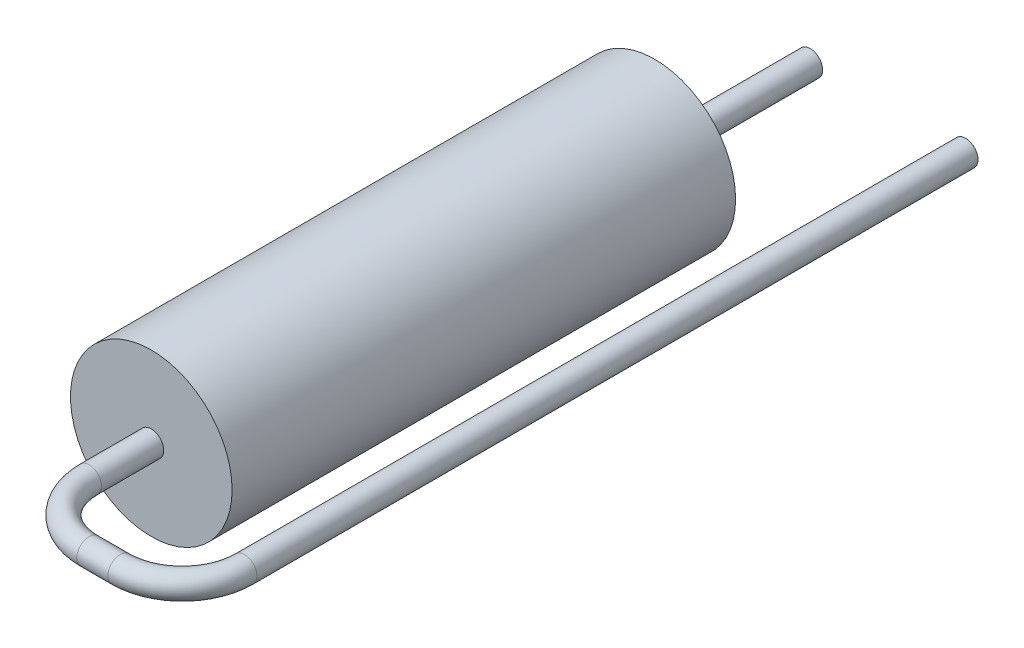
ISO-10303-21;
HEADER;
FILE_DESCRIPTION(('STEP AP214'),'2;1');
FILE_NAME('part.step','',(''),(''),'','','');
FILE_SCHEMA(('AUTOMOTIVE_DESIGN { 1 0 10303 214 1 1 1 1 }'));
ENDSEC;
DATA;
#1=APPLICATION_CONTEXT('core data for automotive mechanical design processes');
#2=APPLICATION_PROTOCOL_DEFINITION('international standard','automotive_design',2000,#1);
#3=PRODUCT_CONTEXT('',#1,'mechanical');
#4=PRODUCT('Part','Part','',(#3));
#5=PRODUCT_RELATED_PRODUCT_CATEGORY('part','',(#4));
#6=PRODUCT_DEFINITION_FORMATION('','',#4);
#7=PRODUCT_DEFINITION_CONTEXT('part definition',#1,'design');
#8=PRODUCT_DEFINITION('design','',#6,#7);
#9=PRODUCT_DEFINITION_SHAPE('','',#8);
#10=(LENGTH_UNIT() NAMED_UNIT(*) SI_UNIT(.MILLI.,.METRE.));
#11=(NAMED_UNIT(*) PLANE_ANGLE_UNIT() SI_UNIT($,.RADIAN.));
#12=(NAMED_UNIT(*) SI_UNIT($,.STERADIAN.) SOLID_ANGLE_UNIT());
#13=UNCERTAINTY_MEASURE_WITH_UNIT(LENGTH_MEASURE(1.E-05),#10,'distance_accuracy_value','');
#14=(GEOMETRIC_REPRESENTATION_CONTEXT(3) GLOBAL_UNCERTAINTY_ASSIGNED_CONTEXT((#13)) GLOBAL_UNIT_ASSIGNED_CONTEXT((#10,
#11,#12)) REPRESENTATION_CONTEXT('',''));
#15=CARTESIAN_POINT('',(0.,0.,0.));
#16=DIRECTION('',(0.,0.,1.));
#17=DIRECTION('',(1.,0.,0.));
#18=AXIS2_PLACEMENT_3D('',#15,#16,#17);
#19=CARTESIAN_POINT('',(0.,0.,0.));
#20=DIRECTION('',(0.,0.,1.));
#21=DIRECTION('',(1.,0.,0.));
#22=AXIS2_PLACEMENT_3D('',#19,#20,#21);
#23=PLANE('',#22);
#24=CARTESIAN_POINT('',(0.,0.,0.));
#25=DIRECTION('',(0.,0.,1.));
#26=DIRECTION('',(1.,0.,0.));
#27=AXIS2_PLACEMENT_3D('',#24,#25,#26);
#28=CIRCLE('',#27,2.6);
#29=CARTESIAN_POINT('',(2.6,0.,0.));
#30=VERTEX_POINT('',#29);
#31=EDGE_CURVE('E47',#30,#30,#28,.T.);
#32=ORIENTED_EDGE('',*,*,#31,.F.);
#33=EDGE_LOOP('',(#32));
#34=FACE_BOUND('',#33,.T.);
#35=CARTESIAN_POINT('',(0.,0.,0.));
#36=DIRECTION('',(0.,0.,1.));
#37=DIRECTION('',(1.,0.,0.));
#38=AXIS2_PLACEMENT_3D('',#35,#36,#37);
#39=CIRCLE('',#38,0.4);
#40=CARTESIAN_POINT('',(0.4,0.,0.));
#41=VERTEX_POINT('',#40);
#42=EDGE_CURVE('E10',#41,#41,#39,.F.);
#43=ORIENTED_EDGE('',*,*,#42,.F.);
#44=EDGE_LOOP('',(#43));
#45=FACE_BOUND('',#44,.T.);
#46=ADVANCED_FACE('F31',(#34,#45),#23,.F.);
#47=CARTESIAN_POINT('',(0.,0.,16.2));
#48=DIRECTION('',(0.,0.,-1.));
#49=DIRECTION('',(-1.,0.,0.));
#50=AXIS2_PLACEMENT_3D('',#47,#48,#49);
#51=CYLINDRICAL_SURFACE('',#50,2.6);
#52=CARTESIAN_POINT('',(0.,0.,16.2));
#53=DIRECTION('',(0.,0.,1.));
#54=DIRECTION('',(1.,0.,0.));
#55=AXIS2_PLACEMENT_3D('',#52,#53,#54);
#56=CIRCLE('',#55,2.6);
#57=CARTESIAN_POINT('',(2.6,0.,16.2));
#58=VERTEX_POINT('',#57);
#59=EDGE_CURVE('E42',#58,#58,#56,.T.);
#60=ORIENTED_EDGE('',*,*,#59,.F.);
#61=EDGE_LOOP('',(#60));
#62=FACE_BOUND('',#61,.T.);
#63=ORIENTED_EDGE('',*,*,#31,.T.);
#64=EDGE_LOOP('',(#63));
#65=FACE_BOUND('',#64,.T.);
#66=ADVANCED_FACE('F33',(#62,#65),#51,.T.);
#67=CARTESIAN_POINT('',(0.,0.,16.2));
#68=DIRECTION('',(0.,0.,1.));
#69=DIRECTION('',(1.,0.,0.));
#70=AXIS2_PLACEMENT_3D('',#67,#68,#69);
#71=PLANE('',#70);
#72=CARTESIAN_POINT('',(0.,0.,16.2));
#73=DIRECTION('',(0.,0.,1.));
#74=DIRECTION('',(1.,0.,0.));
#75=AXIS2_PLACEMENT_3D('',#72,#73,#74);
#76=CIRCLE('',#75,0.4);
#77=CARTESIAN_POINT('',(0.4,0.,16.2));
#78=VERTEX_POINT('',#77);
#79=EDGE_CURVE('E38',#78,#78,#76,.T.);
#80=ORIENTED_EDGE('',*,*,#79,.F.);
#81=EDGE_LOOP('',(#80));
#82=FACE_BOUND('',#81,.T.);
#83=ORIENTED_EDGE('',*,*,#59,.T.);
#84=EDGE_LOOP('',(#83));
#85=FACE_BOUND('',#84,.T.);
#86=ADVANCED_FACE('F73',(#82,#85),#71,.T.);
#87=CARTESIAN_POINT('',(5.,0.,18.2));
#88=DIRECTION('',(0.,0.,-1.));
#89=DIRECTION('',(-1.,0.,0.));
#90=AXIS2_PLACEMENT_3D('',#87,#88,#89);
#91=CYLINDRICAL_SURFACE('',#90,0.4);
#92=CARTESIAN_POINT('',(5.,0.,18.2));
#93=DIRECTION('',(0.,0.,-1.));
#94=DIRECTION('',(-1.,0.,0.));
#95=AXIS2_PLACEMENT_3D('',#92,#93,#94);
#96=CIRCLE('',#95,0.4);
#97=CARTESIAN_POINT('',(5.4,0.,18.2));
#98=VERTEX_POINT('',#97);
#99=EDGE_CURVE('E59',#98,#98,#96,.T.);
#100=ORIENTED_EDGE('',*,*,#99,.T.);
#101=EDGE_LOOP('',(#100));
#102=FACE_BOUND('',#101,.T.);
#103=CARTESIAN_POINT('',(5.,0.,-5.));
#104=DIRECTION('',(0.,0.,-1.));
#105=DIRECTION('',(-1.,0.,0.));
#106=AXIS2_PLACEMENT_3D('',#103,#104,#105);
#107=CIRCLE('',#106,0.4);
#108=CARTESIAN_POINT('',(4.6,0.,-4.99999999999999));
#109=VERTEX_POINT('',#108);
#110=EDGE_CURVE('E62',#109,#109,#107,.T.);
#111=ORIENTED_EDGE('',*,*,#110,.F.);
#112=EDGE_LOOP('',(#111));
#113=FACE_BOUND('',#112,.T.);
#114=ADVANCED_FACE('F78',(#102,#113),#91,.T.);
#115=CARTESIAN_POINT('',(3.,0.,18.2));
#116=DIRECTION('',(0.,1.,0.));
#117=DIRECTION('',(0.,0.,1.));
#118=AXIS2_PLACEMENT_3D('',#115,#116,#117);
#119=TOROIDAL_SURFACE('',#118,2.,0.4);
#120=CARTESIAN_POINT('',(2.99999999999999,0.,20.2));
#121=DIRECTION('',(1.,0.,0.));
#122=DIRECTION('',(0.,0.,-1.));
#123=AXIS2_PLACEMENT_3D('',#120,#121,#122);
#124=CIRCLE('',#123,0.4);
#125=CARTESIAN_POINT('',(2.99999999999998,0.,20.6));
#126=VERTEX_POINT('',#125);
#127=EDGE_CURVE('E56',#126,#126,#124,.T.);
#128=CARTESIAN_POINT('',(3.,0.,18.2));
#129=DIRECTION('',(0.,1.,0.));
#130=DIRECTION('',(0.,0.,1.));
#131=AXIS2_PLACEMENT_3D('',#128,#129,#130);
#132=CIRCLE('',#131,2.4);
#133=EDGE_CURVE('',#126,#98,#132,.T.);
#134=ORIENTED_EDGE('',*,*,#127,.T.);
#135=ORIENTED_EDGE('',*,*,#99,.F.);
#136=ORIENTED_EDGE('',*,*,#133,.T.);
#137=ORIENTED_EDGE('',*,*,#133,.F.);
#138=EDGE_LOOP('',(#134,#136,#135,#137));
#139=FACE_BOUND('',#138,.T.);
#140=ADVANCED_FACE('F82',(#139),#119,.T.);
#141=CARTESIAN_POINT('',(2.00000000000002,0.,20.2));
#142=DIRECTION('',(1.,0.,0.));
#143=DIRECTION('',(0.,0.,-1.));
#144=AXIS2_PLACEMENT_3D('',#141,#142,#143);
#145=CYLINDRICAL_SURFACE('',#144,0.4);
#146=CARTESIAN_POINT('',(2.00000000000002,0.,20.2));
#147=DIRECTION('',(1.,0.,0.));
#148=DIRECTION('',(0.,0.,-1.));
#149=AXIS2_PLACEMENT_3D('',#146,#147,#148);
#150=CIRCLE('',#149,0.4);
#151=CARTESIAN_POINT('',(2.00000000000002,0.,20.6));
#152=VERTEX_POINT('',#151);
#153=EDGE_CURVE('E53',#152,#152,#150,.T.);
#154=ORIENTED_EDGE('',*,*,#153,.T.);
#155=EDGE_LOOP('',(#154));
#156=FACE_BOUND('',#155,.T.);
#157=ORIENTED_EDGE('',*,*,#127,.F.);
#158=EDGE_LOOP('',(#157));
#159=FACE_BOUND('',#158,.T.);
#160=ADVANCED_FACE('F86',(#156,#159),#145,.T.);
#161=CARTESIAN_POINT('',(2.,0.,18.2));
#162=DIRECTION('',(0.,1.,0.));
#163=DIRECTION('',(0.,0.,1.));
#164=AXIS2_PLACEMENT_3D('',#161,#162,#163);
#165=TOROIDAL_SURFACE('',#164,2.,0.4);
#166=CARTESIAN_POINT('',(0.,0.,18.2));
#167=DIRECTION('',(0.,0.,1.));
#168=DIRECTION('',(1.,0.,0.));
#169=AXIS2_PLACEMENT_3D('',#166,#167,#168);
#170=CIRCLE('',#169,0.4);
#171=CARTESIAN_POINT('',(-0.4,0.,18.2));
#172=VERTEX_POINT('',#171);
#173=EDGE_CURVE('E51',#172,#172,#170,.T.);
#174=CARTESIAN_POINT('',(2.,0.,18.2));
#175=DIRECTION('',(0.,1.,0.));
#176=DIRECTION('',(0.,0.,1.));
#177=AXIS2_PLACEMENT_3D('',#174,#175,#176);
#178=CIRCLE('',#177,2.4);
#179=EDGE_CURVE('',#172,#152,#178,.T.);
#180=ORIENTED_EDGE('',*,*,#173,.T.);
#181=ORIENTED_EDGE('',*,*,#153,.F.);
#182=ORIENTED_EDGE('',*,*,#179,.T.);
#183=ORIENTED_EDGE('',*,*,#179,.F.);
#184=EDGE_LOOP('',(#180,#182,#181,#183));
#185=FACE_BOUND('',#184,.T.);
#186=ADVANCED_FACE('F90',(#185),#165,.T.);
#187=CARTESIAN_POINT('',(0.,0.,18.2));
#188=DIRECTION('',(0.,0.,-1.));
#189=DIRECTION('',(-1.,0.,0.));
#190=AXIS2_PLACEMENT_3D('',#187,#188,#189);
#191=CYLINDRICAL_SURFACE('',#190,0.4);
#192=ORIENTED_EDGE('',*,*,#173,.F.);
#193=EDGE_LOOP('',(#192));
#194=FACE_BOUND('',#193,.T.);
#195=ORIENTED_EDGE('',*,*,#79,.T.);
#196=EDGE_LOOP('',(#195));
#197=FACE_BOUND('',#196,.T.);
#198=ADVANCED_FACE('F94',(#194,#197),#191,.T.);
#199=CARTESIAN_POINT('',(5.,0.,-5.));
#200=DIRECTION('',(0.,0.,-1.));
#201=DIRECTION('',(-1.,0.,0.));
#202=AXIS2_PLACEMENT_3D('',#199,#200,#201);
#203=PLANE('',#202);
#204=ORIENTED_EDGE('',*,*,#110,.T.);
#205=EDGE_LOOP('',(#204));
#206=FACE_BOUND('',#205,.T.);
#207=ADVANCED_FACE('F98',(#206),#203,.T.);
#208=CARTESIAN_POINT('',(0.,0.,-6.13137084989832));
#209=DIRECTION('',(0.,0.,1.));
#210=DIRECTION('',(1.,0.,0.));
#211=AXIS2_PLACEMENT_3D('',#208,#209,#210);
#212=CYLINDRICAL_SURFACE('',#211,0.4);
#213=ORIENTED_EDGE('',*,*,#42,.T.);
#214=EDGE_LOOP('',(#213));
#215=FACE_BOUND('',#214,.T.);
#216=CARTESIAN_POINT('',(0.,0.,-4.99999999999984));
#217=DIRECTION('',(0.,0.,-1.));
#218=DIRECTION('',(-1.,0.,0.));
#219=AXIS2_PLACEMENT_3D('',#216,#217,#218);
#220=CIRCLE('',#219,0.4);
#221=CARTESIAN_POINT('',(-0.4,0.,-4.99999999999983));
#222=VERTEX_POINT('',#221);
#223=EDGE_CURVE('E114',#222,#222,#220,.T.);
#224=ORIENTED_EDGE('',*,*,#223,.F.);
#225=EDGE_LOOP('',(#224));
#226=FACE_BOUND('',#225,.T.);
#227=ADVANCED_FACE('F102',(#215,#226),#212,.T.);
#228=CARTESIAN_POINT('',(5.,0.,-5.));
#229=DIRECTION('',(0.,0.,-1.));
#230=DIRECTION('',(-1.,0.,0.));
#231=AXIS2_PLACEMENT_3D('',#228,#229,#230);
#232=PLANE('',#231);
#233=ORIENTED_EDGE('',*,*,#223,.T.);
#234=EDGE_LOOP('',(#233));
#235=FACE_BOUND('',#234,.T.);
#236=ADVANCED_FACE('F104',(#235),#232,.T.);
#237=CLOSED_SHELL('',(#46,#66,#86,#114,#140,#160,#186,#198,#207,#227,#236));
#238=MANIFOLD_SOLID_BREP('B2',#237);
#239=ADVANCED_BREP_SHAPE_REPRESENTATION('',(#18,#238),#14);
#240=SHAPE_DEFINITION_REPRESENTATION(#9,#239);
ENDSEC;
END-ISO-10303-21;
